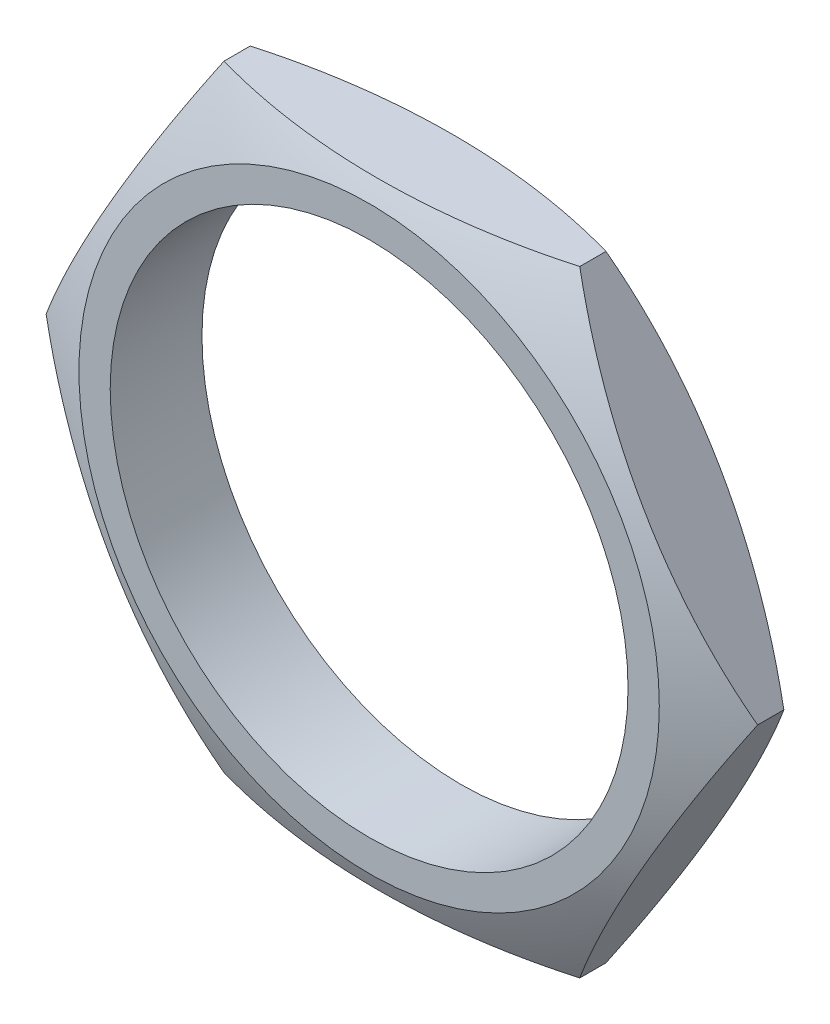
ISO-10303-21;
HEADER;
FILE_DESCRIPTION(('STEP AP214'),'2;1');
FILE_NAME('part.step','',(''),(''),'','','');
FILE_SCHEMA(('AUTOMOTIVE_DESIGN { 1 0 10303 214 1 1 1 1 }'));
ENDSEC;
DATA;
#1=APPLICATION_CONTEXT('core data for automotive mechanical design processes');
#2=APPLICATION_PROTOCOL_DEFINITION('international standard','automotive_design',2000,#1);
#3=PRODUCT_CONTEXT('',#1,'mechanical');
#4=PRODUCT('Part','Part','',(#3));
#5=PRODUCT_RELATED_PRODUCT_CATEGORY('part','',(#4));
#6=PRODUCT_DEFINITION_FORMATION('','',#4);
#7=PRODUCT_DEFINITION_CONTEXT('part definition',#1,'design');
#8=PRODUCT_DEFINITION('design','',#6,#7);
#9=PRODUCT_DEFINITION_SHAPE('','',#8);
#10=(LENGTH_UNIT() NAMED_UNIT(*) SI_UNIT(.MILLI.,.METRE.));
#11=(NAMED_UNIT(*) PLANE_ANGLE_UNIT() SI_UNIT($,.RADIAN.));
#12=(NAMED_UNIT(*) SI_UNIT($,.STERADIAN.) SOLID_ANGLE_UNIT());
#13=UNCERTAINTY_MEASURE_WITH_UNIT(LENGTH_MEASURE(1.E-05),#10,'distance_accuracy_value','');
#14=(GEOMETRIC_REPRESENTATION_CONTEXT(3) GLOBAL_UNCERTAINTY_ASSIGNED_CONTEXT((#13)) GLOBAL_UNIT_ASSIGNED_CONTEXT((#10,
#11,#12)) REPRESENTATION_CONTEXT('',''));
#15=CARTESIAN_POINT('',(0.,0.,0.));
#16=DIRECTION('',(0.,0.,1.));
#17=DIRECTION('',(1.,0.,0.));
#18=AXIS2_PLACEMENT_3D('',#15,#16,#17);
#19=CARTESIAN_POINT('',(5.42709253038259,-9.39999999999994,1.4));
#20=DIRECTION('',(-0.866025403784442,0.499999999999995,0.));
#21=DIRECTION('',(-0.499999999999995,-0.866025403784442,0.));
#22=AXIS2_PLACEMENT_3D('',#19,#20,#21);
#23=PLANE('',#22);
#24=CARTESIAN_POINT('',(8.14063879557378,-4.69999999999997,-18.8083701215299));
#25=DIRECTION('',(-0.866025403784442,0.499999999999995,0.));
#26=DIRECTION('',(-0.499999999999995,-0.866025403784442,0.));
#27=AXIS2_PLACEMENT_3D('',#24,#25,#26);
#28=CIRCLE('',#27,19.9603310608571);
#29=CARTESIAN_POINT('',(5.4270925303826,-9.39999999999994,0.400000000000001));
#30=VERTEX_POINT('',#29);
#31=CARTESIAN_POINT('',(10.854185060765,0.,0.400000000000001));
#32=VERTEX_POINT('',#31);
#33=EDGE_CURVE('E85',#30,#32,#28,.T.);
#34=ORIENTED_EDGE('',*,*,#33,.F.);
#35=DIRECTION('',(0.,0.,-1.));
#36=VECTOR('',#35,1.);
#37=CARTESIAN_POINT('',(5.42709253038259,-9.39999999999994,1.4));
#38=LINE('',#37,#36);
#39=CARTESIAN_POINT('',(5.42709253038259,-9.39999999999994,-0.400000000000005));
#40=VERTEX_POINT('',#39);
#41=EDGE_CURVE('E56',#30,#40,#38,.T.);
#42=ORIENTED_EDGE('',*,*,#41,.T.);
#43=CARTESIAN_POINT('',(8.14063879557378,-4.69999999999997,18.8083701215299));
#44=DIRECTION('',(-0.866025403784442,0.499999999999995,0.));
#45=DIRECTION('',(-0.499999999999995,-0.866025403784442,0.));
#46=AXIS2_PLACEMENT_3D('',#43,#44,#45);
#47=CIRCLE('',#46,19.9603310608571);
#48=CARTESIAN_POINT('',(10.854185060765,0.,-0.400000000000001));
#49=VERTEX_POINT('',#48);
#50=EDGE_CURVE('E102',#49,#40,#47,.T.);
#51=ORIENTED_EDGE('',*,*,#50,.F.);
#52=DIRECTION('',(0.,0.,-1.));
#53=VECTOR('',#52,1.);
#54=CARTESIAN_POINT('',(10.854185060765,0.,1.4));
#55=LINE('',#54,#53);
#56=EDGE_CURVE('E41',#32,#49,#55,.T.);
#57=ORIENTED_EDGE('',*,*,#56,.F.);
#58=EDGE_LOOP('',(#34,#42,#51,#57));
#59=FACE_BOUND('',#58,.T.);
#60=ADVANCED_FACE('F34',(#59),#23,.F.);
#61=CARTESIAN_POINT('',(10.854185060765,0.,1.4));
#62=DIRECTION('',(-0.866025403784438,-0.500000000000001,0.));
#63=DIRECTION('',(0.500000000000001,-0.866025403784438,0.));
#64=AXIS2_PLACEMENT_3D('',#61,#62,#63);
#65=PLANE('',#64);
#66=CARTESIAN_POINT('',(8.14063879557372,4.70000000000001,-18.8083701215299));
#67=DIRECTION('',(-0.866025403784438,-0.500000000000001,0.));
#68=DIRECTION('',(0.500000000000001,-0.866025403784438,0.));
#69=AXIS2_PLACEMENT_3D('',#66,#67,#68);
#70=CIRCLE('',#69,19.9603310608571);
#71=CARTESIAN_POINT('',(5.42709253038247,9.40000000000002,0.400000000000001));
#72=VERTEX_POINT('',#71);
#73=EDGE_CURVE('E88',#32,#72,#70,.T.);
#74=ORIENTED_EDGE('',*,*,#73,.F.);
#75=ORIENTED_EDGE('',*,*,#56,.T.);
#76=CARTESIAN_POINT('',(8.14063879557372,4.70000000000001,18.8083701215299));
#77=DIRECTION('',(-0.866025403784438,-0.500000000000001,0.));
#78=DIRECTION('',(0.500000000000001,-0.866025403784438,0.));
#79=AXIS2_PLACEMENT_3D('',#76,#77,#78);
#80=CIRCLE('',#79,19.9603310608571);
#81=CARTESIAN_POINT('',(5.42709253038247,9.40000000000002,-0.400000000000001));
#82=VERTEX_POINT('',#81);
#83=EDGE_CURVE('E119',#82,#49,#80,.T.);
#84=ORIENTED_EDGE('',*,*,#83,.F.);
#85=DIRECTION('',(0.,0.,-1.));
#86=VECTOR('',#85,1.);
#87=CARTESIAN_POINT('',(5.42709253038246,9.40000000000002,1.4));
#88=LINE('',#87,#86);
#89=EDGE_CURVE('E99',#72,#82,#88,.T.);
#90=ORIENTED_EDGE('',*,*,#89,.F.);
#91=EDGE_LOOP('',(#74,#75,#84,#90));
#92=FACE_BOUND('',#91,.T.);
#93=ADVANCED_FACE('F96',(#92),#65,.F.);
#94=CARTESIAN_POINT('',(5.42709253038246,9.40000000000002,1.4));
#95=DIRECTION('',(0.,-1.,0.));
#96=DIRECTION('',(1.,0.,0.));
#97=AXIS2_PLACEMENT_3D('',#94,#95,#96);
#98=PLANE('',#97);
#99=CARTESIAN_POINT('',(0.,9.4,-18.8083701215299));
#100=DIRECTION('',(0.,-1.,0.));
#101=DIRECTION('',(1.,0.,0.));
#102=AXIS2_PLACEMENT_3D('',#99,#100,#101);
#103=CIRCLE('',#102,19.9603310608571);
#104=CARTESIAN_POINT('',(-5.42709253038253,9.39999999999998,0.400000000000001));
#105=VERTEX_POINT('',#104);
#106=EDGE_CURVE('E100',#72,#105,#103,.T.);
#107=ORIENTED_EDGE('',*,*,#106,.F.);
#108=ORIENTED_EDGE('',*,*,#89,.T.);
#109=CARTESIAN_POINT('',(0.,9.4,18.8083701215299));
#110=DIRECTION('',(0.,-1.,0.));
#111=DIRECTION('',(1.,0.,0.));
#112=AXIS2_PLACEMENT_3D('',#109,#110,#111);
#113=CIRCLE('',#112,19.9603310608571);
#114=CARTESIAN_POINT('',(-5.42709253038253,9.39999999999998,-0.400000000000001));
#115=VERTEX_POINT('',#114);
#116=EDGE_CURVE('E121',#115,#82,#113,.T.);
#117=ORIENTED_EDGE('',*,*,#116,.F.);
#118=DIRECTION('',(0.,0.,-1.));
#119=VECTOR('',#118,1.);
#120=CARTESIAN_POINT('',(-5.42709253038253,9.39999999999998,1.4));
#121=LINE('',#120,#119);
#122=EDGE_CURVE('E103',#105,#115,#121,.T.);
#123=ORIENTED_EDGE('',*,*,#122,.F.);
#124=EDGE_LOOP('',(#107,#108,#117,#123));
#125=FACE_BOUND('',#124,.T.);
#126=ADVANCED_FACE('F156',(#125),#98,.F.);
#127=CARTESIAN_POINT('',(-5.42709253038253,9.39999999999998,1.4));
#128=DIRECTION('',(0.866025403784442,-0.499999999999995,0.));
#129=DIRECTION('',(0.499999999999995,0.866025403784442,0.));
#130=AXIS2_PLACEMENT_3D('',#127,#128,#129);
#131=PLANE('',#130);
#132=CARTESIAN_POINT('',(-8.14063879557375,4.69999999999995,-18.8083701215299));
#133=DIRECTION('',(0.866025403784442,-0.499999999999995,0.));
#134=DIRECTION('',(0.499999999999995,0.866025403784442,0.));
#135=AXIS2_PLACEMENT_3D('',#132,#133,#134);
#136=CIRCLE('',#135,19.9603310608571);
#137=CARTESIAN_POINT('',(-10.854185060765,0.,0.400000000000001));
#138=VERTEX_POINT('',#137);
#139=EDGE_CURVE('E133',#105,#138,#136,.T.);
#140=ORIENTED_EDGE('',*,*,#139,.F.);
#141=ORIENTED_EDGE('',*,*,#122,.T.);
#142=CARTESIAN_POINT('',(-8.14063879557375,4.69999999999995,18.8083701215299));
#143=DIRECTION('',(0.866025403784442,-0.499999999999995,0.));
#144=DIRECTION('',(0.499999999999995,0.866025403784442,0.));
#145=AXIS2_PLACEMENT_3D('',#142,#143,#144);
#146=CIRCLE('',#145,19.9603310608571);
#147=CARTESIAN_POINT('',(-10.854185060765,0.,-0.400000000000001));
#148=VERTEX_POINT('',#147);
#149=EDGE_CURVE('E124',#148,#115,#146,.T.);
#150=ORIENTED_EDGE('',*,*,#149,.F.);
#151=DIRECTION('',(0.,0.,-1.));
#152=VECTOR('',#151,1.);
#153=CARTESIAN_POINT('',(-10.854185060765,0.,1.4));
#154=LINE('',#153,#152);
#155=EDGE_CURVE('E107',#138,#148,#154,.T.);
#156=ORIENTED_EDGE('',*,*,#155,.F.);
#157=EDGE_LOOP('',(#140,#141,#150,#156));
#158=FACE_BOUND('',#157,.T.);
#159=ADVANCED_FACE('F160',(#158),#131,.F.);
#160=CARTESIAN_POINT('',(-10.854185060765,0.,1.4));
#161=DIRECTION('',(0.866025403784435,0.500000000000007,0.));
#162=DIRECTION('',(-0.500000000000007,0.866025403784435,0.));
#163=AXIS2_PLACEMENT_3D('',#160,#161,#162);
#164=PLANE('',#163);
#165=CARTESIAN_POINT('',(-8.14063879557368,-4.70000000000007,-18.8083701215299));
#166=DIRECTION('',(0.866025403784435,0.500000000000007,0.));
#167=DIRECTION('',(-0.500000000000007,0.866025403784435,0.));
#168=AXIS2_PLACEMENT_3D('',#165,#166,#167);
#169=CIRCLE('',#168,19.9603310608571);
#170=CARTESIAN_POINT('',(-5.4270925303824,-9.40000000000006,0.400000000000005));
#171=VERTEX_POINT('',#170);
#172=EDGE_CURVE('E48',#138,#171,#169,.T.);
#173=ORIENTED_EDGE('',*,*,#172,.F.);
#174=ORIENTED_EDGE('',*,*,#155,.T.);
#175=CARTESIAN_POINT('',(-8.14063879557368,-4.70000000000007,18.8083701215299));
#176=DIRECTION('',(0.866025403784435,0.500000000000007,0.));
#177=DIRECTION('',(-0.500000000000007,0.866025403784435,0.));
#178=AXIS2_PLACEMENT_3D('',#175,#176,#177);
#179=CIRCLE('',#178,19.9603310608571);
#180=CARTESIAN_POINT('',(-5.4270925303824,-9.40000000000006,-0.400000000000001));
#181=VERTEX_POINT('',#180);
#182=EDGE_CURVE('E127',#181,#148,#179,.T.);
#183=ORIENTED_EDGE('',*,*,#182,.F.);
#184=DIRECTION('',(0.,0.,-1.));
#185=VECTOR('',#184,1.);
#186=CARTESIAN_POINT('',(-5.4270925303824,-9.40000000000006,1.4));
#187=LINE('',#186,#185);
#188=EDGE_CURVE('E109',#171,#181,#187,.T.);
#189=ORIENTED_EDGE('',*,*,#188,.F.);
#190=EDGE_LOOP('',(#173,#174,#183,#189));
#191=FACE_BOUND('',#190,.T.);
#192=ADVANCED_FACE('F166',(#191),#164,.F.);
#193=CARTESIAN_POINT('',(-5.4270925303824,-9.40000000000006,1.4));
#194=DIRECTION('',(0.,1.,0.));
#195=DIRECTION('',(-1.,0.,0.));
#196=AXIS2_PLACEMENT_3D('',#193,#194,#195);
#197=PLANE('',#196);
#198=CARTESIAN_POINT('',(0.,-9.4,-18.8083701215299));
#199=DIRECTION('',(0.,1.,0.));
#200=DIRECTION('',(-1.,0.,0.));
#201=AXIS2_PLACEMENT_3D('',#198,#199,#200);
#202=CIRCLE('',#201,19.9603310608571);
#203=EDGE_CURVE('E90',#171,#30,#202,.T.);
#204=ORIENTED_EDGE('',*,*,#203,.F.);
#205=ORIENTED_EDGE('',*,*,#188,.T.);
#206=CARTESIAN_POINT('',(0.,-9.4,18.8083701215299));
#207=DIRECTION('',(0.,1.,0.));
#208=DIRECTION('',(-1.,0.,0.));
#209=AXIS2_PLACEMENT_3D('',#206,#207,#208);
#210=CIRCLE('',#209,19.9603310608571);
#211=EDGE_CURVE('E11',#40,#181,#210,.T.);
#212=ORIENTED_EDGE('',*,*,#211,.F.);
#213=ORIENTED_EDGE('',*,*,#41,.F.);
#214=EDGE_LOOP('',(#204,#205,#212,#213));
#215=FACE_BOUND('',#214,.T.);
#216=ADVANCED_FACE('F170',(#215),#197,.F.);
#217=CARTESIAN_POINT('',(0.,0.,1.4));
#218=DIRECTION('',(0.,0.,1.));
#219=DIRECTION('',(1.,0.,0.));
#220=AXIS2_PLACEMENT_3D('',#217,#218,#219);
#221=PLANE('',#220);
#222=CARTESIAN_POINT('',(0.,0.,1.4));
#223=DIRECTION('',(0.,0.,1.));
#224=DIRECTION('',(1.,0.,0.));
#225=AXIS2_PLACEMENT_3D('',#222,#223,#224);
#226=CIRCLE('',#225,7.9);
#227=CARTESIAN_POINT('',(7.9,0.,1.4));
#228=VERTEX_POINT('',#227);
#229=EDGE_CURVE('E112',#228,#228,#226,.T.);
#230=ORIENTED_EDGE('',*,*,#229,.F.);
#231=EDGE_LOOP('',(#230));
#232=FACE_BOUND('',#231,.T.);
#233=CARTESIAN_POINT('',(0.,0.,1.4));
#234=DIRECTION('',(0.,0.,1.));
#235=DIRECTION('',(1.,0.,0.));
#236=AXIS2_PLACEMENT_3D('',#233,#234,#235);
#237=CIRCLE('',#236,8.85418506076498);
#238=CARTESIAN_POINT('',(8.85418506076498,0.,1.4));
#239=VERTEX_POINT('',#238);
#240=EDGE_CURVE('E137',#239,#239,#237,.T.);
#241=ORIENTED_EDGE('',*,*,#240,.T.);
#242=EDGE_LOOP('',(#241));
#243=FACE_BOUND('',#242,.T.);
#244=ADVANCED_FACE('F141',(#232,#243),#221,.T.);
#245=CARTESIAN_POINT('',(0.,0.,-1.4));
#246=DIRECTION('',(0.,0.,1.));
#247=DIRECTION('',(1.,0.,0.));
#248=AXIS2_PLACEMENT_3D('',#245,#246,#247);
#249=PLANE('',#248);
#250=CARTESIAN_POINT('',(0.,0.,-1.4));
#251=DIRECTION('',(0.,0.,1.));
#252=DIRECTION('',(1.,0.,0.));
#253=AXIS2_PLACEMENT_3D('',#250,#251,#252);
#254=CIRCLE('',#253,7.9);
#255=CARTESIAN_POINT('',(7.9,0.,-1.4));
#256=VERTEX_POINT('',#255);
#257=EDGE_CURVE('E113',#256,#256,#254,.T.);
#258=ORIENTED_EDGE('',*,*,#257,.T.);
#259=EDGE_LOOP('',(#258));
#260=FACE_BOUND('',#259,.T.);
#261=CARTESIAN_POINT('',(0.,0.,-1.4));
#262=DIRECTION('',(0.,0.,1.));
#263=DIRECTION('',(1.,0.,0.));
#264=AXIS2_PLACEMENT_3D('',#261,#262,#263);
#265=CIRCLE('',#264,8.85418506076498);
#266=CARTESIAN_POINT('',(8.85418506076498,0.,-1.4));
#267=VERTEX_POINT('',#266);
#268=EDGE_CURVE('E92',#267,#267,#265,.T.);
#269=ORIENTED_EDGE('',*,*,#268,.F.);
#270=EDGE_LOOP('',(#269));
#271=FACE_BOUND('',#270,.T.);
#272=ADVANCED_FACE('F175',(#260,#271),#249,.F.);
#273=CARTESIAN_POINT('',(0.,0.,1.4));
#274=DIRECTION('',(0.,0.,-1.));
#275=DIRECTION('',(-1.,0.,0.));
#276=AXIS2_PLACEMENT_3D('',#273,#274,#275);
#277=CYLINDRICAL_SURFACE('',#276,7.9);
#278=ORIENTED_EDGE('',*,*,#229,.T.);
#279=EDGE_LOOP('',(#278));
#280=FACE_BOUND('',#279,.T.);
#281=ORIENTED_EDGE('',*,*,#257,.F.);
#282=EDGE_LOOP('',(#281));
#283=FACE_BOUND('',#282,.T.);
#284=ADVANCED_FACE('F149',(#280,#283),#277,.F.);
#285=CARTESIAN_POINT('',(0.,0.,18.8083701215299));
#286=DIRECTION('',(0.,0.,1.));
#287=DIRECTION('',(-1.,0.,0.));
#288=AXIS2_PLACEMENT_3D('',#285,#286,#287);
#289=SPHERICAL_SURFACE('',#288,22.0629738716026);
#290=ORIENTED_EDGE('',*,*,#268,.T.);
#291=EDGE_LOOP('',(#290));
#292=FACE_BOUND('',#291,.T.);
#293=ORIENTED_EDGE('',*,*,#50,.T.);
#294=ORIENTED_EDGE('',*,*,#211,.T.);
#295=ORIENTED_EDGE('',*,*,#182,.T.);
#296=ORIENTED_EDGE('',*,*,#149,.T.);
#297=ORIENTED_EDGE('',*,*,#116,.T.);
#298=ORIENTED_EDGE('',*,*,#83,.T.);
#299=EDGE_LOOP('',(#293,#294,#295,#296,#297,#298));
#300=FACE_BOUND('',#299,.T.);
#301=ADVANCED_FACE('F144',(#292,#300),#289,.T.);
#302=CARTESIAN_POINT('',(0.,0.,-18.8083701215299));
#303=DIRECTION('',(0.,0.,-1.));
#304=DIRECTION('',(-1.,0.,0.));
#305=AXIS2_PLACEMENT_3D('',#302,#303,#304);
#306=SPHERICAL_SURFACE('',#305,22.0629738716026);
#307=ORIENTED_EDGE('',*,*,#240,.F.);
#308=EDGE_LOOP('',(#307));
#309=FACE_BOUND('',#308,.T.);
#310=ORIENTED_EDGE('',*,*,#33,.T.);
#311=ORIENTED_EDGE('',*,*,#73,.T.);
#312=ORIENTED_EDGE('',*,*,#106,.T.);
#313=ORIENTED_EDGE('',*,*,#139,.T.);
#314=ORIENTED_EDGE('',*,*,#172,.T.);
#315=ORIENTED_EDGE('',*,*,#203,.T.);
#316=EDGE_LOOP('',(#310,#311,#312,#313,#314,#315));
#317=FACE_BOUND('',#316,.T.);
#318=ADVANCED_FACE('F87',(#309,#317),#306,.T.);
#319=CLOSED_SHELL('',(#60,#93,#126,#159,#192,#216,#244,#272,#284,#301,#318));
#320=MANIFOLD_SOLID_BREP('B2',#319);
#321=ADVANCED_BREP_SHAPE_REPRESENTATION('',(#18,#320),#14);
#322=SHAPE_DEFINITION_REPRESENTATION(#9,#321);
ENDSEC;
END-ISO-10303-21;
